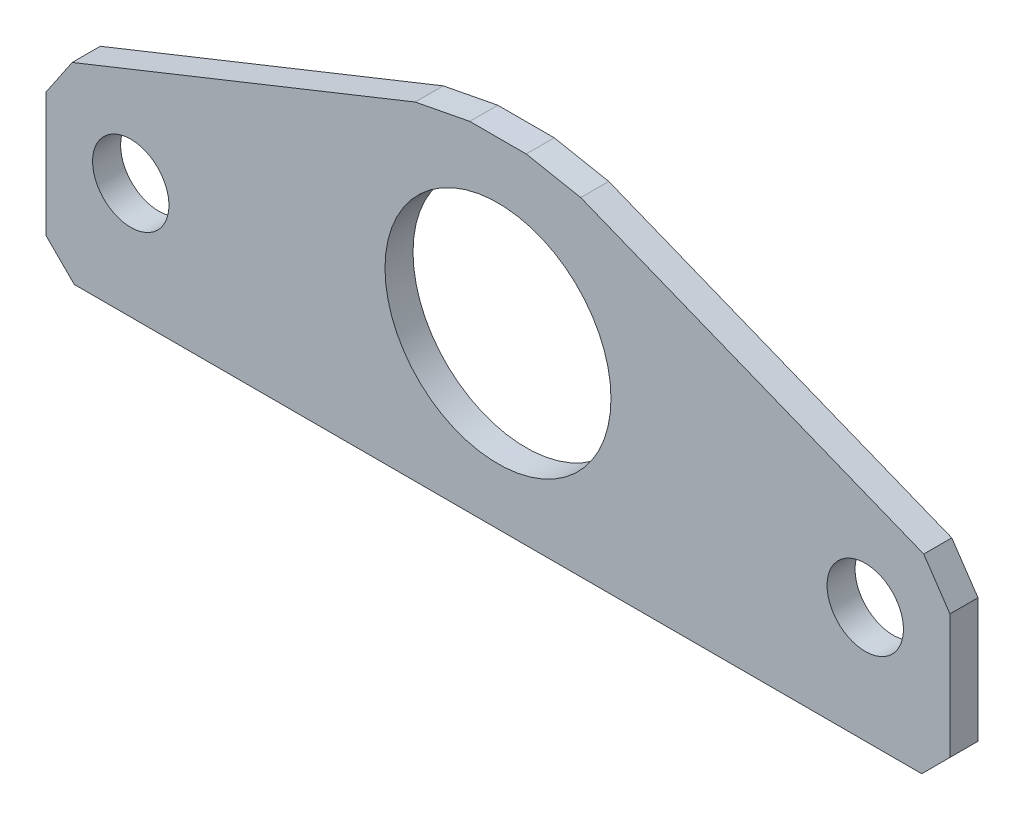
ISO-10303-21;
HEADER;
FILE_DESCRIPTION(('STEP AP214'),'2;1');
FILE_NAME('part.step','',(''),(''),'','','');
FILE_SCHEMA(('AUTOMOTIVE_DESIGN { 1 0 10303 214 1 1 1 1 }'));
ENDSEC;
DATA;
#1=APPLICATION_CONTEXT('core data for automotive mechanical design processes');
#2=APPLICATION_PROTOCOL_DEFINITION('international standard','automotive_design',2000,#1);
#3=PRODUCT_CONTEXT('',#1,'mechanical');
#4=PRODUCT('Part','Part','',(#3));
#5=PRODUCT_RELATED_PRODUCT_CATEGORY('part','',(#4));
#6=PRODUCT_DEFINITION_FORMATION('','',#4);
#7=PRODUCT_DEFINITION_CONTEXT('part definition',#1,'design');
#8=PRODUCT_DEFINITION('design','',#6,#7);
#9=PRODUCT_DEFINITION_SHAPE('','',#8);
#10=(LENGTH_UNIT() NAMED_UNIT(*) SI_UNIT(.MILLI.,.METRE.));
#11=(NAMED_UNIT(*) PLANE_ANGLE_UNIT() SI_UNIT($,.RADIAN.));
#12=(NAMED_UNIT(*) SI_UNIT($,.STERADIAN.) SOLID_ANGLE_UNIT());
#13=UNCERTAINTY_MEASURE_WITH_UNIT(LENGTH_MEASURE(1.E-05),#10,'distance_accuracy_value','');
#14=(GEOMETRIC_REPRESENTATION_CONTEXT(3) GLOBAL_UNCERTAINTY_ASSIGNED_CONTEXT((#13)) GLOBAL_UNIT_ASSIGNED_CONTEXT((#10,
#11,#12)) REPRESENTATION_CONTEXT('',''));
#15=CARTESIAN_POINT('',(0.,0.,0.));
#16=DIRECTION('',(0.,0.,1.));
#17=DIRECTION('',(1.,0.,0.));
#18=AXIS2_PLACEMENT_3D('',#15,#16,#17);
#19=CARTESIAN_POINT('',(25.4,20.955,1.5748));
#20=DIRECTION('',(0.,0.,-1.));
#21=DIRECTION('',(-1.,0.,0.));
#22=AXIS2_PLACEMENT_3D('',#19,#20,#21);
#23=PLANE('',#22);
#24=CARTESIAN_POINT('',(0.,0.,1.5748));
#25=DIRECTION('',(0.,0.,-1.));
#26=DIRECTION('',(-1.,0.,0.));
#27=AXIS2_PLACEMENT_3D('',#24,#25,#26);
#28=CIRCLE('',#27,6.35);
#29=CARTESIAN_POINT('',(-6.35,0.,1.5748));
#30=VERTEX_POINT('',#29);
#31=EDGE_CURVE('E136',#30,#30,#28,.T.);
#32=ORIENTED_EDGE('',*,*,#31,.T.);
#33=EDGE_LOOP('',(#32));
#34=FACE_BOUND('',#33,.T.);
#35=CARTESIAN_POINT('',(20.6375,-3.01285020999999,1.5748));
#36=DIRECTION('',(0.,0.,-1.));
#37=DIRECTION('',(-1.,0.,0.));
#38=AXIS2_PLACEMENT_3D('',#35,#36,#37);
#39=CIRCLE('',#38,2.1463);
#40=CARTESIAN_POINT('',(18.4912,-3.01285020999999,1.5748));
#41=VERTEX_POINT('',#40);
#42=EDGE_CURVE('E138',#41,#41,#39,.T.);
#43=ORIENTED_EDGE('',*,*,#42,.T.);
#44=EDGE_LOOP('',(#43));
#45=FACE_BOUND('',#44,.T.);
#46=DIRECTION('',(0.560628809305184,0.828067230469273,0.));
#47=VECTOR('',#46,1.);
#48=CARTESIAN_POINT('',(-25.4,-0.952500000000011,1.5748));
#49=LINE('',#48,#47);
#50=CARTESIAN_POINT('',(-23.9260432532196,1.22458269871215,1.5748));
#51=VERTEX_POINT('',#50);
#52=CARTESIAN_POINT('',(-25.4,-0.952500000000013,1.5748));
#53=VERTEX_POINT('',#52);
#54=EDGE_CURVE('E117',#51,#53,#49,.F.);
#55=ORIENTED_EDGE('',*,*,#54,.T.);
#56=DIRECTION('',(0.,1.,0.));
#57=VECTOR('',#56,1.);
#58=CARTESIAN_POINT('',(-25.4,0.635,1.5748));
#59=LINE('',#58,#57);
#60=CARTESIAN_POINT('',(-25.4,-7.9375,1.5748));
#61=VERTEX_POINT('',#60);
#62=EDGE_CURVE('E107',#53,#61,#59,.F.);
#63=ORIENTED_EDGE('',*,*,#62,.T.);
#64=DIRECTION('',(-0.707106781186547,0.707106781186548,0.));
#65=VECTOR('',#64,1.);
#66=CARTESIAN_POINT('',(-23.8125,-9.525,1.5748));
#67=LINE('',#66,#65);
#68=CARTESIAN_POINT('',(-23.8125,-9.525,1.5748));
#69=VERTEX_POINT('',#68);
#70=EDGE_CURVE('E140',#61,#69,#67,.F.);
#71=ORIENTED_EDGE('',*,*,#70,.T.);
#72=DIRECTION('',(-1.,0.,0.));
#73=VECTOR('',#72,1.);
#74=CARTESIAN_POINT('',(-25.4,-9.525,1.5748));
#75=LINE('',#74,#73);
#76=CARTESIAN_POINT('',(23.8125,-9.525,1.5748));
#77=VERTEX_POINT('',#76);
#78=EDGE_CURVE('E150',#69,#77,#75,.F.);
#79=ORIENTED_EDGE('',*,*,#78,.T.);
#80=DIRECTION('',(-0.707106781186547,-0.707106781186548,0.));
#81=VECTOR('',#80,1.);
#82=CARTESIAN_POINT('',(25.4,-7.93749999999999,1.5748));
#83=LINE('',#82,#81);
#84=CARTESIAN_POINT('',(25.4,-7.93749999999999,1.5748));
#85=VERTEX_POINT('',#84);
#86=EDGE_CURVE('E154',#77,#85,#83,.F.);
#87=ORIENTED_EDGE('',*,*,#86,.T.);
#88=DIRECTION('',(0.,-1.,0.));
#89=VECTOR('',#88,1.);
#90=CARTESIAN_POINT('',(25.4,0.635000000000006,1.5748));
#91=LINE('',#90,#89);
#92=CARTESIAN_POINT('',(25.4,-0.952500000000007,1.5748));
#93=VERTEX_POINT('',#92);
#94=EDGE_CURVE('E159',#85,#93,#91,.F.);
#95=ORIENTED_EDGE('',*,*,#94,.T.);
#96=DIRECTION('',(0.560628809305184,-0.828067230469273,0.));
#97=VECTOR('',#96,1.);
#98=CARTESIAN_POINT('',(23.9260432532196,1.22458269871215,1.5748));
#99=LINE('',#98,#97);
#100=CARTESIAN_POINT('',(23.9260432532196,1.22458269871215,1.5748));
#101=VERTEX_POINT('',#100);
#102=EDGE_CURVE('E164',#93,#101,#99,.F.);
#103=ORIENTED_EDGE('',*,*,#102,.T.);
#104=DIRECTION('',(0.928476690885259,-0.371390676354104,0.));
#105=VECTOR('',#104,1.);
#106=CARTESIAN_POINT('',(25.4,0.635000000000006,1.5748));
#107=LINE('',#106,#105);
#108=CARTESIAN_POINT('',(4.64895674678047,8.93541730128782,1.5748));
#109=VERTEX_POINT('',#108);
#110=EDGE_CURVE('E169',#101,#109,#107,.F.);
#111=ORIENTED_EDGE('',*,*,#110,.T.);
#112=DIRECTION('',(0.981956386731422,-0.189107521154951,0.));
#113=VECTOR('',#112,1.);
#114=CARTESIAN_POINT('',(1.58749999999997,9.525,1.5748));
#115=LINE('',#114,#113);
#116=CARTESIAN_POINT('',(1.58749999999986,9.525,1.5748));
#117=VERTEX_POINT('',#116);
#118=EDGE_CURVE('E174',#109,#117,#115,.F.);
#119=ORIENTED_EDGE('',*,*,#118,.T.);
#120=DIRECTION('',(1.,0.,0.));
#121=VECTOR('',#120,1.);
#122=CARTESIAN_POINT('',(-3.175,9.525,1.5748));
#123=LINE('',#122,#121);
#124=CARTESIAN_POINT('',(-1.58749999999997,9.525,1.5748));
#125=VERTEX_POINT('',#124);
#126=EDGE_CURVE('E179',#117,#125,#123,.F.);
#127=ORIENTED_EDGE('',*,*,#126,.T.);
#128=DIRECTION('',(0.981956386731422,0.189107521154951,0.));
#129=VECTOR('',#128,1.);
#130=CARTESIAN_POINT('',(-4.64895674678038,8.93541730128785,1.5748));
#131=LINE('',#130,#129);
#132=CARTESIAN_POINT('',(-4.64895674678053,8.93541730128779,1.5748));
#133=VERTEX_POINT('',#132);
#134=EDGE_CURVE('E184',#125,#133,#131,.F.);
#135=ORIENTED_EDGE('',*,*,#134,.T.);
#136=DIRECTION('',(0.928476690885259,0.371390676354104,0.));
#137=VECTOR('',#136,1.);
#138=CARTESIAN_POINT('',(-25.4,0.635,1.5748));
#139=LINE('',#138,#137);
#140=EDGE_CURVE('E102',#133,#51,#139,.F.);
#141=ORIENTED_EDGE('',*,*,#140,.T.);
#142=EDGE_LOOP('',(#55,#63,#71,#79,#87,#95,#103,#111,#119,#127,#135,#141));
#143=FACE_BOUND('',#142,.T.);
#144=CARTESIAN_POINT('',(-20.6375,-3.01285021,1.5748));
#145=DIRECTION('',(0.,0.,-1.));
#146=DIRECTION('',(-1.,0.,0.));
#147=AXIS2_PLACEMENT_3D('',#144,#145,#146);
#148=CIRCLE('',#147,2.1463);
#149=CARTESIAN_POINT('',(-22.7838,-3.01285021,1.5748));
#150=VERTEX_POINT('',#149);
#151=EDGE_CURVE('E19',#150,#150,#148,.T.);
#152=ORIENTED_EDGE('',*,*,#151,.T.);
#153=EDGE_LOOP('',(#152));
#154=FACE_BOUND('',#153,.T.);
#155=ADVANCED_FACE('F16',(#34,#45,#143,#154),#23,.F.);
#156=CARTESIAN_POINT('',(-20.6375,-3.01285021,1.5748));
#157=DIRECTION('',(0.,0.,-1.));
#158=DIRECTION('',(-1.,0.,0.));
#159=AXIS2_PLACEMENT_3D('',#156,#157,#158);
#160=CYLINDRICAL_SURFACE('',#159,2.1463);
#161=ORIENTED_EDGE('',*,*,#151,.F.);
#162=EDGE_LOOP('',(#161));
#163=FACE_BOUND('',#162,.T.);
#164=CARTESIAN_POINT('',(-20.6375,-3.01285021,0.));
#165=DIRECTION('',(0.,0.,-1.));
#166=DIRECTION('',(-1.,0.,0.));
#167=AXIS2_PLACEMENT_3D('',#164,#165,#166);
#168=CIRCLE('',#167,2.1463);
#169=CARTESIAN_POINT('',(-22.7838,-3.01285021,0.));
#170=VERTEX_POINT('',#169);
#171=EDGE_CURVE('E132',#170,#170,#168,.F.);
#172=ORIENTED_EDGE('',*,*,#171,.F.);
#173=EDGE_LOOP('',(#172));
#174=FACE_BOUND('',#173,.T.);
#175=ADVANCED_FACE('F260',(#163,#174),#160,.F.);
#176=CARTESIAN_POINT('',(-25.4,0.635,1.5748));
#177=DIRECTION('',(1.,0.,0.));
#178=DIRECTION('',(0.,0.,-1.));
#179=AXIS2_PLACEMENT_3D('',#176,#177,#178);
#180=PLANE('',#179);
#181=DIRECTION('',(0.,0.,1.));
#182=VECTOR('',#181,1.);
#183=CARTESIAN_POINT('',(-25.4,-0.952500000000011,1.5748));
#184=LINE('',#183,#182);
#185=CARTESIAN_POINT('',(-25.4,-0.952500000000016,0.));
#186=VERTEX_POINT('',#185);
#187=EDGE_CURVE('E110',#53,#186,#184,.F.);
#188=ORIENTED_EDGE('',*,*,#187,.T.);
#189=DIRECTION('',(0.,1.,0.));
#190=VECTOR('',#189,1.);
#191=CARTESIAN_POINT('',(-25.4,20.955,0.));
#192=LINE('',#191,#190);
#193=CARTESIAN_POINT('',(-25.4,-7.9375,0.));
#194=VERTEX_POINT('',#193);
#195=EDGE_CURVE('E135',#194,#186,#192,.T.);
#196=ORIENTED_EDGE('',*,*,#195,.F.);
#197=DIRECTION('',(0.,0.,1.));
#198=VECTOR('',#197,1.);
#199=CARTESIAN_POINT('',(-25.4,-7.9375,1.5748));
#200=LINE('',#199,#198);
#201=EDGE_CURVE('E113',#194,#61,#200,.T.);
#202=ORIENTED_EDGE('',*,*,#201,.T.);
#203=ORIENTED_EDGE('',*,*,#62,.F.);
#204=EDGE_LOOP('',(#188,#196,#202,#203));
#205=FACE_BOUND('',#204,.T.);
#206=ADVANCED_FACE('F108',(#205),#180,.F.);
#207=CARTESIAN_POINT('',(-25.4,-0.952500000000011,1.5748));
#208=DIRECTION('',(0.828067230469273,-0.560628809305184,0.));
#209=DIRECTION('',(0.560628809305184,0.828067230469273,0.));
#210=AXIS2_PLACEMENT_3D('',#207,#208,#209);
#211=PLANE('',#210);
#212=DIRECTION('',(0.,0.,1.));
#213=VECTOR('',#212,1.);
#214=CARTESIAN_POINT('',(-23.9260432532196,1.22458269871215,1.5748));
#215=LINE('',#214,#213);
#216=CARTESIAN_POINT('',(-23.9260432532196,1.22458269871215,0.));
#217=VERTEX_POINT('',#216);
#218=EDGE_CURVE('E188',#51,#217,#215,.F.);
#219=ORIENTED_EDGE('',*,*,#218,.T.);
#220=DIRECTION('',(0.560628809305186,0.828067230469271,0.));
#221=VECTOR('',#220,1.);
#222=CARTESIAN_POINT('',(-25.4,-0.952500000000016,0.));
#223=LINE('',#222,#221);
#224=EDGE_CURVE('E124',#186,#217,#223,.T.);
#225=ORIENTED_EDGE('',*,*,#224,.F.);
#226=ORIENTED_EDGE('',*,*,#187,.F.);
#227=ORIENTED_EDGE('',*,*,#54,.F.);
#228=EDGE_LOOP('',(#219,#225,#226,#227));
#229=FACE_BOUND('',#228,.T.);
#230=ADVANCED_FACE('F122',(#229),#211,.F.);
#231=CARTESIAN_POINT('',(-25.4,0.635,1.5748));
#232=DIRECTION('',(0.371390676354104,-0.928476690885259,0.));
#233=DIRECTION('',(0.928476690885259,0.371390676354104,0.));
#234=AXIS2_PLACEMENT_3D('',#231,#232,#233);
#235=PLANE('',#234);
#236=ORIENTED_EDGE('',*,*,#218,.F.);
#237=ORIENTED_EDGE('',*,*,#140,.F.);
#238=DIRECTION('',(0.,0.,1.));
#239=VECTOR('',#238,1.);
#240=CARTESIAN_POINT('',(-4.64895674678036,8.93541730128785,1.5748));
#241=LINE('',#240,#239);
#242=CARTESIAN_POINT('',(-4.6489567467806,8.93541730128777,0.));
#243=VERTEX_POINT('',#242);
#244=EDGE_CURVE('E186',#133,#243,#241,.F.);
#245=ORIENTED_EDGE('',*,*,#244,.T.);
#246=DIRECTION('',(0.928476690885259,0.371390676354105,0.));
#247=VECTOR('',#246,1.);
#248=CARTESIAN_POINT('',(-23.9260432532196,1.22458269871215,0.));
#249=LINE('',#248,#247);
#250=EDGE_CURVE('E192',#217,#243,#249,.T.);
#251=ORIENTED_EDGE('',*,*,#250,.F.);
#252=EDGE_LOOP('',(#236,#237,#245,#251));
#253=FACE_BOUND('',#252,.T.);
#254=ADVANCED_FACE('F193',(#253),#235,.F.);
#255=CARTESIAN_POINT('',(-4.64895674678038,8.93541730128785,1.5748));
#256=DIRECTION('',(0.189107521154951,-0.981956386731422,0.));
#257=DIRECTION('',(0.981956386731422,0.189107521154951,0.));
#258=AXIS2_PLACEMENT_3D('',#255,#256,#257);
#259=PLANE('',#258);
#260=DIRECTION('',(0.,0.,-1.));
#261=VECTOR('',#260,1.);
#262=CARTESIAN_POINT('',(-1.58749999999998,9.525,1.5748));
#263=LINE('',#262,#261);
#264=CARTESIAN_POINT('',(-1.58749999999997,9.525,0.));
#265=VERTEX_POINT('',#264);
#266=EDGE_CURVE('E182',#125,#265,#263,.T.);
#267=ORIENTED_EDGE('',*,*,#266,.T.);
#268=DIRECTION('',(0.98195638673142,0.189107521154962,0.));
#269=VECTOR('',#268,1.);
#270=CARTESIAN_POINT('',(-4.64895674678072,8.93541730128775,0.));
#271=LINE('',#270,#269);
#272=EDGE_CURVE('E198',#243,#265,#271,.T.);
#273=ORIENTED_EDGE('',*,*,#272,.F.);
#274=ORIENTED_EDGE('',*,*,#244,.F.);
#275=ORIENTED_EDGE('',*,*,#134,.F.);
#276=EDGE_LOOP('',(#267,#273,#274,#275));
#277=FACE_BOUND('',#276,.T.);
#278=ADVANCED_FACE('F277',(#277),#259,.F.);
#279=CARTESIAN_POINT('',(-3.175,9.525,1.5748));
#280=DIRECTION('',(0.,-1.,0.));
#281=DIRECTION('',(0.,0.,-1.));
#282=AXIS2_PLACEMENT_3D('',#279,#280,#281);
#283=PLANE('',#282);
#284=DIRECTION('',(0.,0.,1.));
#285=VECTOR('',#284,1.);
#286=CARTESIAN_POINT('',(1.58749999999994,9.52500000000001,1.5748));
#287=LINE('',#286,#285);
#288=CARTESIAN_POINT('',(1.58749999999984,9.525,0.));
#289=VERTEX_POINT('',#288);
#290=EDGE_CURVE('E177',#117,#289,#287,.F.);
#291=ORIENTED_EDGE('',*,*,#290,.T.);
#292=DIRECTION('',(-1.,0.,0.));
#293=VECTOR('',#292,1.);
#294=CARTESIAN_POINT('',(25.4,9.525,0.));
#295=LINE('',#294,#293);
#296=EDGE_CURVE('E206',#265,#289,#295,.F.);
#297=ORIENTED_EDGE('',*,*,#296,.F.);
#298=ORIENTED_EDGE('',*,*,#266,.F.);
#299=ORIENTED_EDGE('',*,*,#126,.F.);
#300=EDGE_LOOP('',(#291,#297,#298,#299));
#301=FACE_BOUND('',#300,.T.);
#302=ADVANCED_FACE('F280',(#301),#283,.F.);
#303=CARTESIAN_POINT('',(1.58749999999997,9.525,1.5748));
#304=DIRECTION('',(-0.189107521154951,-0.981956386731422,0.));
#305=DIRECTION('',(0.981956386731422,-0.189107521154951,0.));
#306=AXIS2_PLACEMENT_3D('',#303,#304,#305);
#307=PLANE('',#306);
#308=DIRECTION('',(0.,0.,1.));
#309=VECTOR('',#308,1.);
#310=CARTESIAN_POINT('',(4.64895674678057,8.93541730128778,1.5748));
#311=LINE('',#310,#309);
#312=CARTESIAN_POINT('',(4.64895674678042,8.93541730128784,0.));
#313=VERTEX_POINT('',#312);
#314=EDGE_CURVE('E172',#109,#313,#311,.F.);
#315=ORIENTED_EDGE('',*,*,#314,.T.);
#316=DIRECTION('',(0.981956386731423,-0.189107521154944,0.));
#317=VECTOR('',#316,1.);
#318=CARTESIAN_POINT('',(1.58749999999977,9.52500000000002,0.));
#319=LINE('',#318,#317);
#320=EDGE_CURVE('E209',#289,#313,#319,.T.);
#321=ORIENTED_EDGE('',*,*,#320,.F.);
#322=ORIENTED_EDGE('',*,*,#290,.F.);
#323=ORIENTED_EDGE('',*,*,#118,.F.);
#324=EDGE_LOOP('',(#315,#321,#322,#323));
#325=FACE_BOUND('',#324,.T.);
#326=ADVANCED_FACE('F284',(#325),#307,.F.);
#327=CARTESIAN_POINT('',(25.4,0.635000000000006,1.5748));
#328=DIRECTION('',(-0.371390676354104,-0.928476690885259,0.));
#329=DIRECTION('',(0.928476690885259,-0.371390676354104,0.));
#330=AXIS2_PLACEMENT_3D('',#327,#328,#329);
#331=PLANE('',#330);
#332=DIRECTION('',(0.,0.,1.));
#333=VECTOR('',#332,1.);
#334=CARTESIAN_POINT('',(23.9260432532196,1.22458269871215,1.5748));
#335=LINE('',#334,#333);
#336=CARTESIAN_POINT('',(23.9260432532196,1.22458269871215,0.));
#337=VERTEX_POINT('',#336);
#338=EDGE_CURVE('E167',#101,#337,#335,.F.);
#339=ORIENTED_EDGE('',*,*,#338,.T.);
#340=DIRECTION('',(0.928476690885259,-0.371390676354104,0.));
#341=VECTOR('',#340,1.);
#342=CARTESIAN_POINT('',(4.64895674678038,8.93541730128785,0.));
#343=LINE('',#342,#341);
#344=EDGE_CURVE('E212',#313,#337,#343,.T.);
#345=ORIENTED_EDGE('',*,*,#344,.F.);
#346=ORIENTED_EDGE('',*,*,#314,.F.);
#347=ORIENTED_EDGE('',*,*,#110,.F.);
#348=EDGE_LOOP('',(#339,#345,#346,#347));
#349=FACE_BOUND('',#348,.T.);
#350=ADVANCED_FACE('F288',(#349),#331,.F.);
#351=CARTESIAN_POINT('',(23.9260432532196,1.22458269871215,1.5748));
#352=DIRECTION('',(-0.828067230469273,-0.560628809305184,0.));
#353=DIRECTION('',(0.560628809305184,-0.828067230469273,0.));
#354=AXIS2_PLACEMENT_3D('',#351,#352,#353);
#355=PLANE('',#354);
#356=DIRECTION('',(0.,0.,1.));
#357=VECTOR('',#356,1.);
#358=CARTESIAN_POINT('',(25.4,-0.952500000000006,1.5748));
#359=LINE('',#358,#357);
#360=CARTESIAN_POINT('',(25.4,-0.952500000000007,0.));
#361=VERTEX_POINT('',#360);
#362=EDGE_CURVE('E162',#93,#361,#359,.F.);
#363=ORIENTED_EDGE('',*,*,#362,.T.);
#364=DIRECTION('',(0.560628809305184,-0.828067230469272,0.));
#365=VECTOR('',#364,1.);
#366=CARTESIAN_POINT('',(23.9260432532196,1.22458269871215,0.));
#367=LINE('',#366,#365);
#368=EDGE_CURVE('E215',#337,#361,#367,.T.);
#369=ORIENTED_EDGE('',*,*,#368,.F.);
#370=ORIENTED_EDGE('',*,*,#338,.F.);
#371=ORIENTED_EDGE('',*,*,#102,.F.);
#372=EDGE_LOOP('',(#363,#369,#370,#371));
#373=FACE_BOUND('',#372,.T.);
#374=ADVANCED_FACE('F292',(#373),#355,.F.);
#375=CARTESIAN_POINT('',(25.4,0.635000000000006,1.5748));
#376=DIRECTION('',(-1.,0.,0.));
#377=DIRECTION('',(0.,-1.,0.));
#378=AXIS2_PLACEMENT_3D('',#375,#376,#377);
#379=PLANE('',#378);
#380=DIRECTION('',(0.,0.,1.));
#381=VECTOR('',#380,1.);
#382=CARTESIAN_POINT('',(25.4,-7.93749999999999,1.5748));
#383=LINE('',#382,#381);
#384=CARTESIAN_POINT('',(25.4,-7.93749999999999,0.));
#385=VERTEX_POINT('',#384);
#386=EDGE_CURVE('E157',#85,#385,#383,.F.);
#387=ORIENTED_EDGE('',*,*,#386,.T.);
#388=DIRECTION('',(0.,1.,0.));
#389=VECTOR('',#388,1.);
#390=CARTESIAN_POINT('',(25.4,20.955,0.));
#391=LINE('',#390,#389);
#392=EDGE_CURVE('E218',#361,#385,#391,.F.);
#393=ORIENTED_EDGE('',*,*,#392,.F.);
#394=ORIENTED_EDGE('',*,*,#362,.F.);
#395=ORIENTED_EDGE('',*,*,#94,.F.);
#396=EDGE_LOOP('',(#387,#393,#394,#395));
#397=FACE_BOUND('',#396,.T.);
#398=ADVANCED_FACE('F296',(#397),#379,.F.);
#399=CARTESIAN_POINT('',(25.4,-7.93749999999999,1.5748));
#400=DIRECTION('',(-0.707106781186548,0.707106781186547,0.));
#401=DIRECTION('',(-0.707106781186547,-0.707106781186548,0.));
#402=AXIS2_PLACEMENT_3D('',#399,#400,#401);
#403=PLANE('',#402);
#404=DIRECTION('',(0.,0.,1.));
#405=VECTOR('',#404,1.);
#406=CARTESIAN_POINT('',(23.8125,-9.52499999999999,1.5748));
#407=LINE('',#406,#405);
#408=CARTESIAN_POINT('',(23.8125,-9.525,0.));
#409=VERTEX_POINT('',#408);
#410=EDGE_CURVE('E152',#77,#409,#407,.F.);
#411=ORIENTED_EDGE('',*,*,#410,.T.);
#412=DIRECTION('',(-0.707106781186546,-0.707106781186549,0.));
#413=VECTOR('',#412,1.);
#414=CARTESIAN_POINT('',(25.4,-7.93749999999999,0.));
#415=LINE('',#414,#413);
#416=EDGE_CURVE('E221',#385,#409,#415,.T.);
#417=ORIENTED_EDGE('',*,*,#416,.F.);
#418=ORIENTED_EDGE('',*,*,#386,.F.);
#419=ORIENTED_EDGE('',*,*,#86,.F.);
#420=EDGE_LOOP('',(#411,#417,#418,#419));
#421=FACE_BOUND('',#420,.T.);
#422=ADVANCED_FACE('F240',(#421),#403,.F.);
#423=CARTESIAN_POINT('',(-25.4,-9.525,1.5748));
#424=DIRECTION('',(0.,1.,0.));
#425=DIRECTION('',(-1.,0.,0.));
#426=AXIS2_PLACEMENT_3D('',#423,#424,#425);
#427=PLANE('',#426);
#428=DIRECTION('',(0.,0.,1.));
#429=VECTOR('',#428,1.);
#430=CARTESIAN_POINT('',(-23.8125,-9.525,1.5748));
#431=LINE('',#430,#429);
#432=CARTESIAN_POINT('',(-23.8125,-9.525,0.));
#433=VERTEX_POINT('',#432);
#434=EDGE_CURVE('E34',#69,#433,#431,.F.);
#435=ORIENTED_EDGE('',*,*,#434,.T.);
#436=DIRECTION('',(-1.,0.,0.));
#437=VECTOR('',#436,1.);
#438=CARTESIAN_POINT('',(25.4,-9.525,0.));
#439=LINE('',#438,#437);
#440=EDGE_CURVE('E224',#409,#433,#439,.T.);
#441=ORIENTED_EDGE('',*,*,#440,.F.);
#442=ORIENTED_EDGE('',*,*,#410,.F.);
#443=ORIENTED_EDGE('',*,*,#78,.F.);
#444=EDGE_LOOP('',(#435,#441,#442,#443));
#445=FACE_BOUND('',#444,.T.);
#446=ADVANCED_FACE('F230',(#445),#427,.F.);
#447=CARTESIAN_POINT('',(-23.8125,-9.525,1.5748));
#448=DIRECTION('',(0.707106781186548,0.707106781186547,0.));
#449=DIRECTION('',(-0.707106781186547,0.707106781186548,0.));
#450=AXIS2_PLACEMENT_3D('',#447,#448,#449);
#451=PLANE('',#450);
#452=ORIENTED_EDGE('',*,*,#201,.F.);
#453=DIRECTION('',(-0.707106781186544,0.707106781186551,0.));
#454=VECTOR('',#453,1.);
#455=CARTESIAN_POINT('',(-23.8125,-9.525,0.));
#456=LINE('',#455,#454);
#457=EDGE_CURVE('E131',#433,#194,#456,.T.);
#458=ORIENTED_EDGE('',*,*,#457,.F.);
#459=ORIENTED_EDGE('',*,*,#434,.F.);
#460=ORIENTED_EDGE('',*,*,#70,.F.);
#461=EDGE_LOOP('',(#452,#458,#459,#460));
#462=FACE_BOUND('',#461,.T.);
#463=ADVANCED_FACE('F227',(#462),#451,.F.);
#464=CARTESIAN_POINT('',(20.6375,-3.01285020999999,1.5748));
#465=DIRECTION('',(0.,0.,-1.));
#466=DIRECTION('',(-1.,0.,0.));
#467=AXIS2_PLACEMENT_3D('',#464,#465,#466);
#468=CYLINDRICAL_SURFACE('',#467,2.1463);
#469=ORIENTED_EDGE('',*,*,#42,.F.);
#470=EDGE_LOOP('',(#469));
#471=FACE_BOUND('',#470,.T.);
#472=CARTESIAN_POINT('',(20.6375,-3.01285020999999,0.));
#473=DIRECTION('',(0.,0.,-1.));
#474=DIRECTION('',(-1.,0.,0.));
#475=AXIS2_PLACEMENT_3D('',#472,#473,#474);
#476=CIRCLE('',#475,2.1463);
#477=CARTESIAN_POINT('',(18.4912,-3.01285020999999,0.));
#478=VERTEX_POINT('',#477);
#479=EDGE_CURVE('E25',#478,#478,#476,.F.);
#480=ORIENTED_EDGE('',*,*,#479,.F.);
#481=EDGE_LOOP('',(#480));
#482=FACE_BOUND('',#481,.T.);
#483=ADVANCED_FACE('F229',(#471,#482),#468,.F.);
#484=CARTESIAN_POINT('',(0.,0.,1.5748));
#485=DIRECTION('',(0.,0.,-1.));
#486=DIRECTION('',(-1.,0.,0.));
#487=AXIS2_PLACEMENT_3D('',#484,#485,#486);
#488=CYLINDRICAL_SURFACE('',#487,6.35);
#489=ORIENTED_EDGE('',*,*,#31,.F.);
#490=EDGE_LOOP('',(#489));
#491=FACE_BOUND('',#490,.T.);
#492=CARTESIAN_POINT('',(0.,0.,0.));
#493=DIRECTION('',(0.,0.,-1.));
#494=DIRECTION('',(-1.,0.,0.));
#495=AXIS2_PLACEMENT_3D('',#492,#493,#494);
#496=CIRCLE('',#495,6.35);
#497=CARTESIAN_POINT('',(-6.35,0.,0.));
#498=VERTEX_POINT('',#497);
#499=EDGE_CURVE('E11',#498,#498,#496,.F.);
#500=ORIENTED_EDGE('',*,*,#499,.F.);
#501=EDGE_LOOP('',(#500));
#502=FACE_BOUND('',#501,.T.);
#503=ADVANCED_FACE('F237',(#491,#502),#488,.F.);
#504=CARTESIAN_POINT('',(25.4,20.955,0.));
#505=DIRECTION('',(0.,0.,-1.));
#506=DIRECTION('',(-1.,0.,0.));
#507=AXIS2_PLACEMENT_3D('',#504,#505,#506);
#508=PLANE('',#507);
#509=ORIENTED_EDGE('',*,*,#499,.T.);
#510=EDGE_LOOP('',(#509));
#511=FACE_BOUND('',#510,.T.);
#512=ORIENTED_EDGE('',*,*,#479,.T.);
#513=EDGE_LOOP('',(#512));
#514=FACE_BOUND('',#513,.T.);
#515=ORIENTED_EDGE('',*,*,#440,.T.);
#516=ORIENTED_EDGE('',*,*,#457,.T.);
#517=ORIENTED_EDGE('',*,*,#195,.T.);
#518=ORIENTED_EDGE('',*,*,#224,.T.);
#519=ORIENTED_EDGE('',*,*,#250,.T.);
#520=ORIENTED_EDGE('',*,*,#272,.T.);
#521=ORIENTED_EDGE('',*,*,#296,.T.);
#522=ORIENTED_EDGE('',*,*,#320,.T.);
#523=ORIENTED_EDGE('',*,*,#344,.T.);
#524=ORIENTED_EDGE('',*,*,#368,.T.);
#525=ORIENTED_EDGE('',*,*,#392,.T.);
#526=ORIENTED_EDGE('',*,*,#416,.T.);
#527=EDGE_LOOP('',(#515,#516,#517,#518,#519,#520,#521,#522,#523,#524,#525,#526));
#528=FACE_BOUND('',#527,.T.);
#529=ORIENTED_EDGE('',*,*,#171,.T.);
#530=EDGE_LOOP('',(#529));
#531=FACE_BOUND('',#530,.T.);
#532=ADVANCED_FACE('F201',(#511,#514,#528,#531),#508,.T.);
#533=CLOSED_SHELL('',(#155,#175,#206,#230,#254,#278,#302,#326,#350,#374,#398,#422,#446,#463,
#483,#503,#532));
#534=MANIFOLD_SOLID_BREP('B1',#533);
#535=ADVANCED_BREP_SHAPE_REPRESENTATION('',(#18,#534),#14);
#536=SHAPE_DEFINITION_REPRESENTATION(#9,#535);
ENDSEC;
END-ISO-10303-21;
